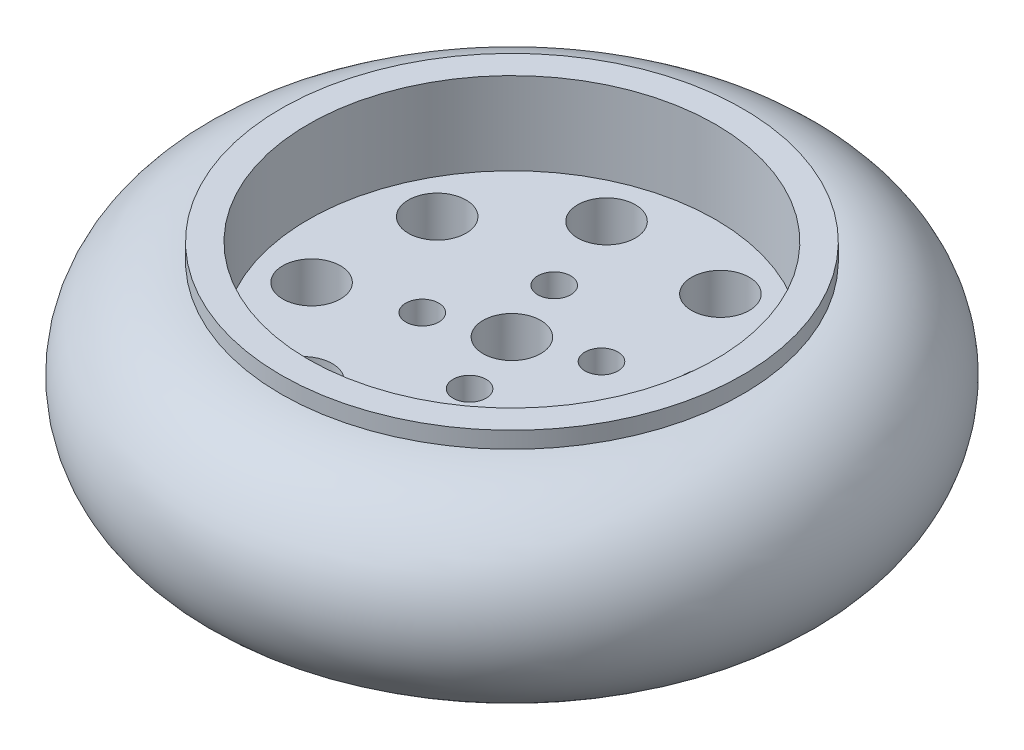
ISO-10303-21;
HEADER;
FILE_DESCRIPTION(('STEP AP214'),'2;1');
FILE_NAME('part.step','',(''),(''),'','','');
FILE_SCHEMA(('AUTOMOTIVE_DESIGN { 1 0 10303 214 1 1 1 1 }'));
ENDSEC;
DATA;
#1=APPLICATION_CONTEXT('core data for automotive mechanical design processes');
#2=APPLICATION_PROTOCOL_DEFINITION('international standard','automotive_design',2000,#1);
#3=PRODUCT_CONTEXT('',#1,'mechanical');
#4=PRODUCT('Part','Part','',(#3));
#5=PRODUCT_RELATED_PRODUCT_CATEGORY('part','',(#4));
#6=PRODUCT_DEFINITION_FORMATION('','',#4);
#7=PRODUCT_DEFINITION_CONTEXT('part definition',#1,'design');
#8=PRODUCT_DEFINITION('design','',#6,#7);
#9=PRODUCT_DEFINITION_SHAPE('','',#8);
#10=(LENGTH_UNIT() NAMED_UNIT(*) SI_UNIT(.MILLI.,.METRE.));
#11=(NAMED_UNIT(*) PLANE_ANGLE_UNIT() SI_UNIT($,.RADIAN.));
#12=(NAMED_UNIT(*) SI_UNIT($,.STERADIAN.) SOLID_ANGLE_UNIT());
#13=UNCERTAINTY_MEASURE_WITH_UNIT(LENGTH_MEASURE(1.E-05),#10,'distance_accuracy_value','');
#14=(GEOMETRIC_REPRESENTATION_CONTEXT(3) GLOBAL_UNCERTAINTY_ASSIGNED_CONTEXT((#13)) GLOBAL_UNIT_ASSIGNED_CONTEXT((#10,
#11,#12)) REPRESENTATION_CONTEXT('',''));
#15=CARTESIAN_POINT('',(0.,0.,0.));
#16=DIRECTION('',(0.,0.,1.));
#17=DIRECTION('',(1.,0.,0.));
#18=AXIS2_PLACEMENT_3D('',#15,#16,#17);
#19=CARTESIAN_POINT('',(0.,16.,0.));
#20=DIRECTION('',(0.,1.,0.));
#21=DIRECTION('',(0.,0.,1.));
#22=AXIS2_PLACEMENT_3D('',#19,#20,#21);
#23=PLANE('',#22);
#24=CARTESIAN_POINT('',(0.,16.,0.));
#25=DIRECTION('',(0.,1.,0.));
#26=DIRECTION('',(0.,0.,1.));
#27=AXIS2_PLACEMENT_3D('',#24,#25,#26);
#28=CIRCLE('',#27,3.5);
#29=CARTESIAN_POINT('',(0.,16.,3.5));
#30=VERTEX_POINT('',#29);
#31=EDGE_CURVE('E57',#30,#30,#28,.T.);
#32=ORIENTED_EDGE('',*,*,#31,.F.);
#33=EDGE_LOOP('',(#32));
#34=FACE_BOUND('',#33,.T.);
#35=CARTESIAN_POINT('',(-2.86697991111695,16.,-8.00190141086803));
#36=DIRECTION('',(0.,1.,0.));
#37=DIRECTION('',(0.,0.,1.));
#38=AXIS2_PLACEMENT_3D('',#35,#36,#37);
#39=CIRCLE('',#38,2.);
#40=CARTESIAN_POINT('',(-2.86697991111695,16.,-6.00190141086803));
#41=VERTEX_POINT('',#40);
#42=EDGE_CURVE('E61',#41,#41,#39,.T.);
#43=ORIENTED_EDGE('',*,*,#42,.F.);
#44=EDGE_LOOP('',(#43));
#45=FACE_BOUND('',#44,.T.);
#46=CARTESIAN_POINT('',(-6.40854333073201,16.,-17.886603153705));
#47=DIRECTION('',(0.,1.,0.));
#48=DIRECTION('',(0.,0.,1.));
#49=AXIS2_PLACEMENT_3D('',#46,#47,#48);
#50=CIRCLE('',#49,3.5);
#51=CARTESIAN_POINT('',(-6.40854333073201,16.,-14.386603153705));
#52=VERTEX_POINT('',#51);
#53=EDGE_CURVE('E65',#52,#52,#50,.T.);
#54=ORIENTED_EDGE('',*,*,#53,.F.);
#55=EDGE_LOOP('',(#54));
#56=FACE_BOUND('',#55,.T.);
#57=CARTESIAN_POINT('',(8.00190141086821,16.,-2.86697991111724));
#58=DIRECTION('',(0.,1.,0.));
#59=DIRECTION('',(0.,0.,1.));
#60=AXIS2_PLACEMENT_3D('',#57,#58,#59);
#61=CIRCLE('',#60,2.);
#62=CARTESIAN_POINT('',(8.00190141086821,16.,-0.866979911117241));
#63=VERTEX_POINT('',#62);
#64=EDGE_CURVE('E69',#63,#63,#61,.T.);
#65=ORIENTED_EDGE('',*,*,#64,.F.);
#66=EDGE_LOOP('',(#65));
#67=FACE_BOUND('',#66,.T.);
#68=CARTESIAN_POINT('',(2.86697991111741,16.,8.00190141086792));
#69=DIRECTION('',(0.,1.,0.));
#70=DIRECTION('',(0.,0.,1.));
#71=AXIS2_PLACEMENT_3D('',#68,#69,#70);
#72=CIRCLE('',#71,2.);
#73=CARTESIAN_POINT('',(2.86697991111741,16.,10.0019014108679));
#74=VERTEX_POINT('',#73);
#75=EDGE_CURVE('E73',#74,#74,#72,.T.);
#76=ORIENTED_EDGE('',*,*,#75,.F.);
#77=EDGE_LOOP('',(#76));
#78=FACE_BOUND('',#77,.T.);
#79=CARTESIAN_POINT('',(-8.00190141086775,16.,2.86697991111712));
#80=DIRECTION('',(0.,1.,0.));
#81=DIRECTION('',(0.,0.,1.));
#82=AXIS2_PLACEMENT_3D('',#79,#80,#81);
#83=CIRCLE('',#82,2.);
#84=CARTESIAN_POINT('',(-8.00190141086775,16.,4.86697991111712));
#85=VERTEX_POINT('',#84);
#86=EDGE_CURVE('E77',#85,#85,#83,.T.);
#87=ORIENTED_EDGE('',*,*,#86,.F.);
#88=EDGE_LOOP('',(#87));
#89=FACE_BOUND('',#88,.T.);
#90=CARTESIAN_POINT('',(8.11621393568911,16.,-17.1792628290665));
#91=DIRECTION('',(0.,1.,0.));
#92=DIRECTION('',(0.,0.,1.));
#93=AXIS2_PLACEMENT_3D('',#90,#91,#92);
#94=CIRCLE('',#93,3.50000000000029);
#95=CARTESIAN_POINT('',(8.11621393568911,16.,-13.6792628290663));
#96=VERTEX_POINT('',#95);
#97=EDGE_CURVE('E81',#96,#96,#94,.T.);
#98=ORIENTED_EDGE('',*,*,#97,.F.);
#99=EDGE_LOOP('',(#98));
#100=FACE_BOUND('',#99,.T.);
#101=CARTESIAN_POINT('',(17.8866031537055,16.,-6.40854333073303));
#102=DIRECTION('',(0.,1.,0.));
#103=DIRECTION('',(0.,0.,1.));
#104=AXIS2_PLACEMENT_3D('',#101,#102,#103);
#105=CIRCLE('',#104,3.5000000000009);
#106=CARTESIAN_POINT('',(17.8866031537055,16.,-2.90854333073213));
#107=VERTEX_POINT('',#106);
#108=EDGE_CURVE('E85',#107,#107,#105,.T.);
#109=ORIENTED_EDGE('',*,*,#108,.F.);
#110=EDGE_LOOP('',(#109));
#111=FACE_BOUND('',#110,.T.);
#112=CARTESIAN_POINT('',(17.179262829067,16.,8.11621393568809));
#113=DIRECTION('',(0.,1.,0.));
#114=DIRECTION('',(0.,0.,1.));
#115=AXIS2_PLACEMENT_3D('',#112,#113,#114);
#116=CIRCLE('',#115,3.50000000000149);
#117=CARTESIAN_POINT('',(17.179262829067,16.,11.6162139356896));
#118=VERTEX_POINT('',#117);
#119=EDGE_CURVE('E89',#118,#118,#116,.T.);
#120=ORIENTED_EDGE('',*,*,#119,.F.);
#121=EDGE_LOOP('',(#120));
#122=FACE_BOUND('',#121,.T.);
#123=CARTESIAN_POINT('',(6.40854333073352,16.,17.8866031537045));
#124=DIRECTION('',(0.,1.,0.));
#125=DIRECTION('',(0.,0.,1.));
#126=AXIS2_PLACEMENT_3D('',#123,#124,#125);
#127=CIRCLE('',#126,3.50000000000173);
#128=CARTESIAN_POINT('',(6.40854333073352,16.,21.3866031537062));
#129=VERTEX_POINT('',#128);
#130=EDGE_CURVE('E93',#129,#129,#127,.T.);
#131=ORIENTED_EDGE('',*,*,#130,.F.);
#132=EDGE_LOOP('',(#131));
#133=FACE_BOUND('',#132,.T.);
#134=CARTESIAN_POINT('',(-8.1162139356876,16.,17.179262829066));
#135=DIRECTION('',(0.,1.,0.));
#136=DIRECTION('',(0.,0.,1.));
#137=AXIS2_PLACEMENT_3D('',#134,#135,#136);
#138=CIRCLE('',#137,3.50000000000151);
#139=CARTESIAN_POINT('',(-8.1162139356876,16.,20.6792628290675));
#140=VERTEX_POINT('',#139);
#141=EDGE_CURVE('E97',#140,#140,#138,.T.);
#142=ORIENTED_EDGE('',*,*,#141,.F.);
#143=EDGE_LOOP('',(#142));
#144=FACE_BOUND('',#143,.T.);
#145=CARTESIAN_POINT('',(-17.886603153704,16.,6.40854333073249));
#146=DIRECTION('',(0.,1.,0.));
#147=DIRECTION('',(0.,0.,1.));
#148=AXIS2_PLACEMENT_3D('',#145,#146,#147);
#149=CIRCLE('',#148,3.50000000000096);
#150=CARTESIAN_POINT('',(-17.886603153704,16.,9.90854333073345));
#151=VERTEX_POINT('',#150);
#152=EDGE_CURVE('E100',#151,#151,#149,.T.);
#153=ORIENTED_EDGE('',*,*,#152,.F.);
#154=EDGE_LOOP('',(#153));
#155=FACE_BOUND('',#154,.T.);
#156=CARTESIAN_POINT('',(-17.1792628290655,16.,-8.11621393568862));
#157=DIRECTION('',(0.,1.,0.));
#158=DIRECTION('',(0.,0.,1.));
#159=AXIS2_PLACEMENT_3D('',#156,#157,#158);
#160=CIRCLE('',#159,3.50000000000044);
#161=CARTESIAN_POINT('',(-17.1792628290655,16.,-4.61621393568818));
#162=VERTEX_POINT('',#161);
#163=EDGE_CURVE('E103',#162,#162,#160,.T.);
#164=ORIENTED_EDGE('',*,*,#163,.F.);
#165=EDGE_LOOP('',(#164));
#166=FACE_BOUND('',#165,.T.);
#167=CARTESIAN_POINT('',(0.,16.,0.));
#168=DIRECTION('',(0.,1.,0.));
#169=DIRECTION('',(0.,0.,1.));
#170=AXIS2_PLACEMENT_3D('',#167,#168,#169);
#171=CIRCLE('',#170,24.6987066576452);
#172=CARTESIAN_POINT('',(0.,16.,24.6987066576452));
#173=VERTEX_POINT('',#172);
#174=EDGE_CURVE('E10',#173,#173,#171,.F.);
#175=ORIENTED_EDGE('',*,*,#174,.F.);
#176=EDGE_LOOP('',(#175));
#177=FACE_BOUND('',#176,.T.);
#178=ADVANCED_FACE('F33',(#34,#45,#56,#67,#78,#89,#100,#111,#122,#133,#144,#155,#166,#177),#23,.T.);
#179=CARTESIAN_POINT('',(0.,12.,0.));
#180=DIRECTION('',(0.,1.,0.));
#181=DIRECTION('',(0.,0.,1.));
#182=AXIS2_PLACEMENT_3D('',#179,#180,#181);
#183=TOROIDAL_SURFACE('',#182,28.,12.);
#184=CARTESIAN_POINT('',(0.,24.,0.));
#185=DIRECTION('',(0.,1.,0.));
#186=DIRECTION('',(0.,0.,1.));
#187=AXIS2_PLACEMENT_3D('',#184,#185,#186);
#188=CIRCLE('',#187,28.);
#189=CARTESIAN_POINT('',(0.,24.,28.));
#190=VERTEX_POINT('',#189);
#191=EDGE_CURVE('E41',#190,#190,#188,.T.);
#192=ORIENTED_EDGE('',*,*,#191,.F.);
#193=EDGE_LOOP('',(#192));
#194=FACE_BOUND('',#193,.T.);
#195=CARTESIAN_POINT('',(0.,0.,0.));
#196=DIRECTION('',(0.,-1.,0.));
#197=DIRECTION('',(0.,0.,-1.));
#198=AXIS2_PLACEMENT_3D('',#195,#196,#197);
#199=CIRCLE('',#198,28.);
#200=CARTESIAN_POINT('',(0.,0.,-28.));
#201=VERTEX_POINT('',#200);
#202=EDGE_CURVE('E50',#201,#201,#199,.T.);
#203=ORIENTED_EDGE('',*,*,#202,.F.);
#204=EDGE_LOOP('',(#203));
#205=FACE_BOUND('',#204,.T.);
#206=ADVANCED_FACE('F36',(#194,#205),#183,.T.);
#207=CARTESIAN_POINT('',(0.,8.,0.));
#208=DIRECTION('',(0.,-1.,0.));
#209=DIRECTION('',(0.,0.,-1.));
#210=AXIS2_PLACEMENT_3D('',#207,#208,#209);
#211=CYLINDRICAL_SURFACE('',#210,28.);
#212=CARTESIAN_POINT('',(0.,8.,0.));
#213=DIRECTION('',(0.,-1.,0.));
#214=DIRECTION('',(0.,0.,-1.));
#215=AXIS2_PLACEMENT_3D('',#212,#213,#214);
#216=CIRCLE('',#215,28.);
#217=CARTESIAN_POINT('',(0.,8.,-28.));
#218=VERTEX_POINT('',#217);
#219=EDGE_CURVE('E45',#218,#218,#216,.T.);
#220=ORIENTED_EDGE('',*,*,#219,.F.);
#221=EDGE_LOOP('',(#220));
#222=FACE_BOUND('',#221,.T.);
#223=ORIENTED_EDGE('',*,*,#202,.T.);
#224=EDGE_LOOP('',(#223));
#225=FACE_BOUND('',#224,.T.);
#226=ADVANCED_FACE('F227',(#222,#225),#211,.F.);
#227=CARTESIAN_POINT('',(0.,8.,0.));
#228=DIRECTION('',(0.,-1.,0.));
#229=DIRECTION('',(0.,0.,-1.));
#230=AXIS2_PLACEMENT_3D('',#227,#228,#229);
#231=PLANE('',#230);
#232=CARTESIAN_POINT('',(-17.1792628290655,8.,-8.11621393568862));
#233=DIRECTION('',(0.,-1.,0.));
#234=DIRECTION('',(0.,0.,-1.));
#235=AXIS2_PLACEMENT_3D('',#232,#233,#234);
#236=CIRCLE('',#235,3.50000000000044);
#237=CARTESIAN_POINT('',(-17.1792628290655,8.,-11.6162139356891));
#238=VERTEX_POINT('',#237);
#239=EDGE_CURVE('E101',#238,#238,#236,.T.);
#240=ORIENTED_EDGE('',*,*,#239,.F.);
#241=EDGE_LOOP('',(#240));
#242=FACE_BOUND('',#241,.T.);
#243=CARTESIAN_POINT('',(-17.886603153704,8.,6.40854333073249));
#244=DIRECTION('',(0.,-1.,0.));
#245=DIRECTION('',(0.,0.,-1.));
#246=AXIS2_PLACEMENT_3D('',#243,#244,#245);
#247=CIRCLE('',#246,3.50000000000096);
#248=CARTESIAN_POINT('',(-17.886603153704,8.,2.90854333073153));
#249=VERTEX_POINT('',#248);
#250=EDGE_CURVE('E98',#249,#249,#247,.T.);
#251=ORIENTED_EDGE('',*,*,#250,.F.);
#252=EDGE_LOOP('',(#251));
#253=FACE_BOUND('',#252,.T.);
#254=CARTESIAN_POINT('',(-8.1162139356876,8.,17.179262829066));
#255=DIRECTION('',(0.,-1.,0.));
#256=DIRECTION('',(0.,0.,-1.));
#257=AXIS2_PLACEMENT_3D('',#254,#255,#256);
#258=CIRCLE('',#257,3.50000000000151);
#259=CARTESIAN_POINT('',(-8.1162139356876,8.,13.6792628290645));
#260=VERTEX_POINT('',#259);
#261=EDGE_CURVE('E94',#260,#260,#258,.T.);
#262=ORIENTED_EDGE('',*,*,#261,.F.);
#263=EDGE_LOOP('',(#262));
#264=FACE_BOUND('',#263,.T.);
#265=CARTESIAN_POINT('',(6.40854333073352,8.,17.8866031537045));
#266=DIRECTION('',(0.,-1.,0.));
#267=DIRECTION('',(0.,0.,-1.));
#268=AXIS2_PLACEMENT_3D('',#265,#266,#267);
#269=CIRCLE('',#268,3.50000000000173);
#270=CARTESIAN_POINT('',(6.40854333073352,8.,14.3866031537027));
#271=VERTEX_POINT('',#270);
#272=EDGE_CURVE('E90',#271,#271,#269,.T.);
#273=ORIENTED_EDGE('',*,*,#272,.F.);
#274=EDGE_LOOP('',(#273));
#275=FACE_BOUND('',#274,.T.);
#276=CARTESIAN_POINT('',(17.179262829067,8.,8.11621393568809));
#277=DIRECTION('',(0.,-1.,0.));
#278=DIRECTION('',(0.,0.,-1.));
#279=AXIS2_PLACEMENT_3D('',#276,#277,#278);
#280=CIRCLE('',#279,3.50000000000149);
#281=CARTESIAN_POINT('',(17.179262829067,8.,4.6162139356866));
#282=VERTEX_POINT('',#281);
#283=EDGE_CURVE('E86',#282,#282,#280,.T.);
#284=ORIENTED_EDGE('',*,*,#283,.F.);
#285=EDGE_LOOP('',(#284));
#286=FACE_BOUND('',#285,.T.);
#287=CARTESIAN_POINT('',(17.8866031537055,8.,-6.40854333073303));
#288=DIRECTION('',(0.,-1.,0.));
#289=DIRECTION('',(0.,0.,-1.));
#290=AXIS2_PLACEMENT_3D('',#287,#288,#289);
#291=CIRCLE('',#290,3.5000000000009);
#292=CARTESIAN_POINT('',(17.8866031537055,8.,-9.90854333073394));
#293=VERTEX_POINT('',#292);
#294=EDGE_CURVE('E82',#293,#293,#291,.T.);
#295=ORIENTED_EDGE('',*,*,#294,.F.);
#296=EDGE_LOOP('',(#295));
#297=FACE_BOUND('',#296,.T.);
#298=CARTESIAN_POINT('',(8.11621393568911,8.,-17.1792628290665));
#299=DIRECTION('',(0.,-1.,0.));
#300=DIRECTION('',(0.,0.,-1.));
#301=AXIS2_PLACEMENT_3D('',#298,#299,#300);
#302=CIRCLE('',#301,3.50000000000029);
#303=CARTESIAN_POINT('',(8.11621393568911,8.,-20.6792628290668));
#304=VERTEX_POINT('',#303);
#305=EDGE_CURVE('E78',#304,#304,#302,.T.);
#306=ORIENTED_EDGE('',*,*,#305,.F.);
#307=EDGE_LOOP('',(#306));
#308=FACE_BOUND('',#307,.T.);
#309=CARTESIAN_POINT('',(-8.00190141086775,8.,2.86697991111712));
#310=DIRECTION('',(0.,-1.,0.));
#311=DIRECTION('',(0.,0.,-1.));
#312=AXIS2_PLACEMENT_3D('',#309,#310,#311);
#313=CIRCLE('',#312,2.);
#314=CARTESIAN_POINT('',(-8.00190141086775,8.,0.866979911117123));
#315=VERTEX_POINT('',#314);
#316=EDGE_CURVE('E74',#315,#315,#313,.T.);
#317=ORIENTED_EDGE('',*,*,#316,.F.);
#318=EDGE_LOOP('',(#317));
#319=FACE_BOUND('',#318,.T.);
#320=CARTESIAN_POINT('',(2.86697991111741,8.,8.00190141086792));
#321=DIRECTION('',(0.,-1.,0.));
#322=DIRECTION('',(0.,0.,-1.));
#323=AXIS2_PLACEMENT_3D('',#320,#321,#322);
#324=CIRCLE('',#323,2.);
#325=CARTESIAN_POINT('',(2.86697991111741,8.,6.00190141086792));
#326=VERTEX_POINT('',#325);
#327=EDGE_CURVE('E70',#326,#326,#324,.T.);
#328=ORIENTED_EDGE('',*,*,#327,.F.);
#329=EDGE_LOOP('',(#328));
#330=FACE_BOUND('',#329,.T.);
#331=CARTESIAN_POINT('',(8.00190141086821,8.,-2.86697991111724));
#332=DIRECTION('',(0.,-1.,0.));
#333=DIRECTION('',(0.,0.,-1.));
#334=AXIS2_PLACEMENT_3D('',#331,#332,#333);
#335=CIRCLE('',#334,2.);
#336=CARTESIAN_POINT('',(8.00190141086821,8.,-4.86697991111724));
#337=VERTEX_POINT('',#336);
#338=EDGE_CURVE('E66',#337,#337,#335,.T.);
#339=ORIENTED_EDGE('',*,*,#338,.F.);
#340=EDGE_LOOP('',(#339));
#341=FACE_BOUND('',#340,.T.);
#342=CARTESIAN_POINT('',(-6.40854333073201,8.,-17.886603153705));
#343=DIRECTION('',(0.,-1.,0.));
#344=DIRECTION('',(0.,0.,-1.));
#345=AXIS2_PLACEMENT_3D('',#342,#343,#344);
#346=CIRCLE('',#345,3.5);
#347=CARTESIAN_POINT('',(-6.40854333073201,8.,-21.386603153705));
#348=VERTEX_POINT('',#347);
#349=EDGE_CURVE('E62',#348,#348,#346,.T.);
#350=ORIENTED_EDGE('',*,*,#349,.F.);
#351=EDGE_LOOP('',(#350));
#352=FACE_BOUND('',#351,.T.);
#353=CARTESIAN_POINT('',(-2.86697991111695,8.,-8.00190141086803));
#354=DIRECTION('',(0.,-1.,0.));
#355=DIRECTION('',(0.,0.,-1.));
#356=AXIS2_PLACEMENT_3D('',#353,#354,#355);
#357=CIRCLE('',#356,2.);
#358=CARTESIAN_POINT('',(-2.86697991111695,8.,-10.001901410868));
#359=VERTEX_POINT('',#358);
#360=EDGE_CURVE('E58',#359,#359,#357,.T.);
#361=ORIENTED_EDGE('',*,*,#360,.F.);
#362=EDGE_LOOP('',(#361));
#363=FACE_BOUND('',#362,.T.);
#364=CARTESIAN_POINT('',(0.,8.,0.));
#365=DIRECTION('',(0.,-1.,0.));
#366=DIRECTION('',(0.,0.,-1.));
#367=AXIS2_PLACEMENT_3D('',#364,#365,#366);
#368=CIRCLE('',#367,3.5);
#369=CARTESIAN_POINT('',(0.,8.,-3.5));
#370=VERTEX_POINT('',#369);
#371=EDGE_CURVE('E54',#370,#370,#368,.T.);
#372=ORIENTED_EDGE('',*,*,#371,.F.);
#373=EDGE_LOOP('',(#372));
#374=FACE_BOUND('',#373,.T.);
#375=ORIENTED_EDGE('',*,*,#219,.T.);
#376=EDGE_LOOP('',(#375));
#377=FACE_BOUND('',#376,.T.);
#378=ADVANCED_FACE('F223',(#242,#253,#264,#275,#286,#297,#308,#319,#330,#341,#352,#363,#374,
#377),#231,.T.);
#379=CARTESIAN_POINT('',(0.,0.,0.));
#380=DIRECTION('',(0.,1.,0.));
#381=DIRECTION('',(0.,0.,1.));
#382=AXIS2_PLACEMENT_3D('',#379,#380,#381);
#383=CYLINDRICAL_SURFACE('',#382,3.5);
#384=ORIENTED_EDGE('',*,*,#371,.T.);
#385=EDGE_LOOP('',(#384));
#386=FACE_BOUND('',#385,.T.);
#387=ORIENTED_EDGE('',*,*,#31,.T.);
#388=EDGE_LOOP('',(#387));
#389=FACE_BOUND('',#388,.T.);
#390=ADVANCED_FACE('F141',(#386,#389),#383,.F.);
#391=CARTESIAN_POINT('',(-2.86697991111695,0.,-8.00190141086803));
#392=DIRECTION('',(0.,1.,0.));
#393=DIRECTION('',(0.,0.,1.));
#394=AXIS2_PLACEMENT_3D('',#391,#392,#393);
#395=CYLINDRICAL_SURFACE('',#394,2.);
#396=ORIENTED_EDGE('',*,*,#360,.T.);
#397=EDGE_LOOP('',(#396));
#398=FACE_BOUND('',#397,.T.);
#399=ORIENTED_EDGE('',*,*,#42,.T.);
#400=EDGE_LOOP('',(#399));
#401=FACE_BOUND('',#400,.T.);
#402=ADVANCED_FACE('F216',(#398,#401),#395,.F.);
#403=CARTESIAN_POINT('',(-6.40854333073201,0.,-17.886603153705));
#404=DIRECTION('',(0.,1.,0.));
#405=DIRECTION('',(0.,0.,1.));
#406=AXIS2_PLACEMENT_3D('',#403,#404,#405);
#407=CYLINDRICAL_SURFACE('',#406,3.5);
#408=ORIENTED_EDGE('',*,*,#349,.T.);
#409=EDGE_LOOP('',(#408));
#410=FACE_BOUND('',#409,.T.);
#411=ORIENTED_EDGE('',*,*,#53,.T.);
#412=EDGE_LOOP('',(#411));
#413=FACE_BOUND('',#412,.T.);
#414=ADVANCED_FACE('F212',(#410,#413),#407,.F.);
#415=CARTESIAN_POINT('',(8.00190141086821,0.,-2.86697991111724));
#416=DIRECTION('',(0.,1.,0.));
#417=DIRECTION('',(0.,0.,1.));
#418=AXIS2_PLACEMENT_3D('',#415,#416,#417);
#419=CYLINDRICAL_SURFACE('',#418,2.);
#420=ORIENTED_EDGE('',*,*,#338,.T.);
#421=EDGE_LOOP('',(#420));
#422=FACE_BOUND('',#421,.T.);
#423=ORIENTED_EDGE('',*,*,#64,.T.);
#424=EDGE_LOOP('',(#423));
#425=FACE_BOUND('',#424,.T.);
#426=ADVANCED_FACE('F208',(#422,#425),#419,.F.);
#427=CARTESIAN_POINT('',(2.86697991111741,0.,8.00190141086792));
#428=DIRECTION('',(0.,1.,0.));
#429=DIRECTION('',(0.,0.,1.));
#430=AXIS2_PLACEMENT_3D('',#427,#428,#429);
#431=CYLINDRICAL_SURFACE('',#430,2.);
#432=ORIENTED_EDGE('',*,*,#327,.T.);
#433=EDGE_LOOP('',(#432));
#434=FACE_BOUND('',#433,.T.);
#435=ORIENTED_EDGE('',*,*,#75,.T.);
#436=EDGE_LOOP('',(#435));
#437=FACE_BOUND('',#436,.T.);
#438=ADVANCED_FACE('F204',(#434,#437),#431,.F.);
#439=CARTESIAN_POINT('',(-8.00190141086775,0.,2.86697991111712));
#440=DIRECTION('',(0.,1.,0.));
#441=DIRECTION('',(0.,0.,1.));
#442=AXIS2_PLACEMENT_3D('',#439,#440,#441);
#443=CYLINDRICAL_SURFACE('',#442,2.);
#444=ORIENTED_EDGE('',*,*,#316,.T.);
#445=EDGE_LOOP('',(#444));
#446=FACE_BOUND('',#445,.T.);
#447=ORIENTED_EDGE('',*,*,#86,.T.);
#448=EDGE_LOOP('',(#447));
#449=FACE_BOUND('',#448,.T.);
#450=ADVANCED_FACE('F200',(#446,#449),#443,.F.);
#451=CARTESIAN_POINT('',(8.11621393568911,0.,-17.1792628290665));
#452=DIRECTION('',(0.,1.,0.));
#453=DIRECTION('',(0.,0.,1.));
#454=AXIS2_PLACEMENT_3D('',#451,#452,#453);
#455=CYLINDRICAL_SURFACE('',#454,3.50000000000029);
#456=ORIENTED_EDGE('',*,*,#305,.T.);
#457=EDGE_LOOP('',(#456));
#458=FACE_BOUND('',#457,.T.);
#459=ORIENTED_EDGE('',*,*,#97,.T.);
#460=EDGE_LOOP('',(#459));
#461=FACE_BOUND('',#460,.T.);
#462=ADVANCED_FACE('F196',(#458,#461),#455,.F.);
#463=CARTESIAN_POINT('',(17.8866031537055,0.,-6.40854333073303));
#464=DIRECTION('',(0.,1.,0.));
#465=DIRECTION('',(0.,0.,1.));
#466=AXIS2_PLACEMENT_3D('',#463,#464,#465);
#467=CYLINDRICAL_SURFACE('',#466,3.5000000000009);
#468=ORIENTED_EDGE('',*,*,#294,.T.);
#469=EDGE_LOOP('',(#468));
#470=FACE_BOUND('',#469,.T.);
#471=ORIENTED_EDGE('',*,*,#108,.T.);
#472=EDGE_LOOP('',(#471));
#473=FACE_BOUND('',#472,.T.);
#474=ADVANCED_FACE('F192',(#470,#473),#467,.F.);
#475=CARTESIAN_POINT('',(17.179262829067,0.,8.11621393568809));
#476=DIRECTION('',(0.,1.,0.));
#477=DIRECTION('',(0.,0.,1.));
#478=AXIS2_PLACEMENT_3D('',#475,#476,#477);
#479=CYLINDRICAL_SURFACE('',#478,3.50000000000149);
#480=ORIENTED_EDGE('',*,*,#283,.T.);
#481=EDGE_LOOP('',(#480));
#482=FACE_BOUND('',#481,.T.);
#483=ORIENTED_EDGE('',*,*,#119,.T.);
#484=EDGE_LOOP('',(#483));
#485=FACE_BOUND('',#484,.T.);
#486=ADVANCED_FACE('F188',(#482,#485),#479,.F.);
#487=CARTESIAN_POINT('',(6.40854333073352,0.,17.8866031537045));
#488=DIRECTION('',(0.,1.,0.));
#489=DIRECTION('',(0.,0.,1.));
#490=AXIS2_PLACEMENT_3D('',#487,#488,#489);
#491=CYLINDRICAL_SURFACE('',#490,3.50000000000173);
#492=ORIENTED_EDGE('',*,*,#272,.T.);
#493=EDGE_LOOP('',(#492));
#494=FACE_BOUND('',#493,.T.);
#495=ORIENTED_EDGE('',*,*,#130,.T.);
#496=EDGE_LOOP('',(#495));
#497=FACE_BOUND('',#496,.T.);
#498=ADVANCED_FACE('F181',(#494,#497),#491,.F.);
#499=CARTESIAN_POINT('',(-8.1162139356876,0.,17.179262829066));
#500=DIRECTION('',(0.,1.,0.));
#501=DIRECTION('',(0.,0.,1.));
#502=AXIS2_PLACEMENT_3D('',#499,#500,#501);
#503=CYLINDRICAL_SURFACE('',#502,3.50000000000151);
#504=ORIENTED_EDGE('',*,*,#261,.T.);
#505=EDGE_LOOP('',(#504));
#506=FACE_BOUND('',#505,.T.);
#507=ORIENTED_EDGE('',*,*,#141,.T.);
#508=EDGE_LOOP('',(#507));
#509=FACE_BOUND('',#508,.T.);
#510=ADVANCED_FACE('F172',(#506,#509),#503,.F.);
#511=CARTESIAN_POINT('',(-17.886603153704,0.,6.40854333073249));
#512=DIRECTION('',(0.,1.,0.));
#513=DIRECTION('',(0.,0.,1.));
#514=AXIS2_PLACEMENT_3D('',#511,#512,#513);
#515=CYLINDRICAL_SURFACE('',#514,3.50000000000096);
#516=ORIENTED_EDGE('',*,*,#250,.T.);
#517=EDGE_LOOP('',(#516));
#518=FACE_BOUND('',#517,.T.);
#519=ORIENTED_EDGE('',*,*,#152,.T.);
#520=EDGE_LOOP('',(#519));
#521=FACE_BOUND('',#520,.T.);
#522=ADVANCED_FACE('F169',(#518,#521),#515,.F.);
#523=CARTESIAN_POINT('',(-17.1792628290655,0.,-8.11621393568862));
#524=DIRECTION('',(0.,1.,0.));
#525=DIRECTION('',(0.,0.,1.));
#526=AXIS2_PLACEMENT_3D('',#523,#524,#525);
#527=CYLINDRICAL_SURFACE('',#526,3.50000000000044);
#528=ORIENTED_EDGE('',*,*,#239,.T.);
#529=EDGE_LOOP('',(#528));
#530=FACE_BOUND('',#529,.T.);
#531=ORIENTED_EDGE('',*,*,#163,.T.);
#532=EDGE_LOOP('',(#531));
#533=FACE_BOUND('',#532,.T.);
#534=ADVANCED_FACE('F171',(#530,#533),#527,.F.);
#535=CARTESIAN_POINT('',(0.,26.,0.));
#536=DIRECTION('',(0.,1.,0.));
#537=DIRECTION('',(0.,0.,1.));
#538=AXIS2_PLACEMENT_3D('',#535,#536,#537);
#539=PLANE('',#538);
#540=CARTESIAN_POINT('',(0.,26.,0.));
#541=DIRECTION('',(0.,1.,0.));
#542=DIRECTION('',(0.,0.,1.));
#543=AXIS2_PLACEMENT_3D('',#540,#541,#542);
#544=CIRCLE('',#543,28.);
#545=CARTESIAN_POINT('',(0.,26.,28.));
#546=VERTEX_POINT('',#545);
#547=EDGE_CURVE('E109',#546,#546,#544,.T.);
#548=ORIENTED_EDGE('',*,*,#547,.T.);
#549=EDGE_LOOP('',(#548));
#550=FACE_BOUND('',#549,.T.);
#551=CARTESIAN_POINT('',(0.,26.,0.));
#552=DIRECTION('',(0.,1.,0.));
#553=DIRECTION('',(0.,0.,1.));
#554=AXIS2_PLACEMENT_3D('',#551,#552,#553);
#555=CIRCLE('',#554,24.6987066576452);
#556=CARTESIAN_POINT('',(0.,26.,24.6987066576452));
#557=VERTEX_POINT('',#556);
#558=EDGE_CURVE('E114',#557,#557,#555,.T.);
#559=ORIENTED_EDGE('',*,*,#558,.F.);
#560=EDGE_LOOP('',(#559));
#561=FACE_BOUND('',#560,.T.);
#562=ADVANCED_FACE('F179',(#550,#561),#539,.T.);
#563=CARTESIAN_POINT('',(0.,26.,0.));
#564=DIRECTION('',(0.,-1.,0.));
#565=DIRECTION('',(0.,0.,-1.));
#566=AXIS2_PLACEMENT_3D('',#563,#564,#565);
#567=CYLINDRICAL_SURFACE('',#566,28.);
#568=ORIENTED_EDGE('',*,*,#191,.T.);
#569=EDGE_LOOP('',(#568));
#570=FACE_BOUND('',#569,.T.);
#571=ORIENTED_EDGE('',*,*,#547,.F.);
#572=EDGE_LOOP('',(#571));
#573=FACE_BOUND('',#572,.T.);
#574=ADVANCED_FACE('F343',(#570,#573),#567,.T.);
#575=CARTESIAN_POINT('',(0.,26.,0.));
#576=DIRECTION('',(0.,-1.,0.));
#577=DIRECTION('',(0.,0.,-1.));
#578=AXIS2_PLACEMENT_3D('',#575,#576,#577);
#579=CYLINDRICAL_SURFACE('',#578,24.6987066576452);
#580=ORIENTED_EDGE('',*,*,#558,.T.);
#581=EDGE_LOOP('',(#580));
#582=FACE_BOUND('',#581,.T.);
#583=ORIENTED_EDGE('',*,*,#174,.T.);
#584=EDGE_LOOP('',(#583));
#585=FACE_BOUND('',#584,.T.);
#586=ADVANCED_FACE('F353',(#582,#585),#579,.F.);
#587=CLOSED_SHELL('',(#178,#206,#226,#378,#390,#402,#414,#426,#438,#450,#462,#474,#486,#498,
#510,#522,#534,#562,#574,#586));
#588=MANIFOLD_SOLID_BREP('B2',#587);
#589=ADVANCED_BREP_SHAPE_REPRESENTATION('',(#18,#588),#14);
#590=SHAPE_DEFINITION_REPRESENTATION(#9,#589);
ENDSEC;
END-ISO-10303-21;
